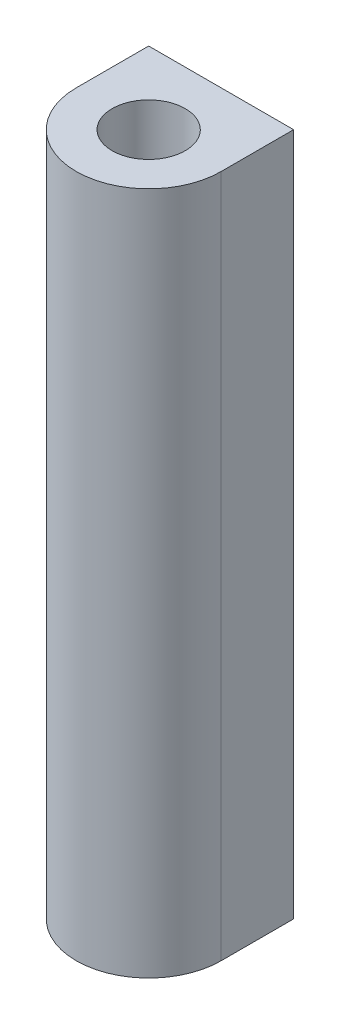
ISO-10303-21;
HEADER;
FILE_DESCRIPTION(('STEP AP214'),'2;1');
FILE_NAME('part.step','',(''),(''),'','','');
FILE_SCHEMA(('AUTOMOTIVE_DESIGN { 1 0 10303 214 1 1 1 1 }'));
ENDSEC;
DATA;
#1=APPLICATION_CONTEXT('core data for automotive mechanical design processes');
#2=APPLICATION_PROTOCOL_DEFINITION('international standard','automotive_design',2000,#1);
#3=PRODUCT_CONTEXT('',#1,'mechanical');
#4=PRODUCT('Part','Part','',(#3));
#5=PRODUCT_RELATED_PRODUCT_CATEGORY('part','',(#4));
#6=PRODUCT_DEFINITION_FORMATION('','',#4);
#7=PRODUCT_DEFINITION_CONTEXT('part definition',#1,'design');
#8=PRODUCT_DEFINITION('design','',#6,#7);
#9=PRODUCT_DEFINITION_SHAPE('','',#8);
#10=(LENGTH_UNIT() NAMED_UNIT(*) SI_UNIT(.MILLI.,.METRE.));
#11=(NAMED_UNIT(*) PLANE_ANGLE_UNIT() SI_UNIT($,.RADIAN.));
#12=(NAMED_UNIT(*) SI_UNIT($,.STERADIAN.) SOLID_ANGLE_UNIT());
#13=UNCERTAINTY_MEASURE_WITH_UNIT(LENGTH_MEASURE(1.E-05),#10,'distance_accuracy_value','');
#14=(GEOMETRIC_REPRESENTATION_CONTEXT(3) GLOBAL_UNCERTAINTY_ASSIGNED_CONTEXT((#13)) GLOBAL_UNIT_ASSIGNED_CONTEXT((#10,
#11,#12)) REPRESENTATION_CONTEXT('',''));
#15=CARTESIAN_POINT('',(0.,0.,0.));
#16=DIRECTION('',(0.,0.,1.));
#17=DIRECTION('',(1.,0.,0.));
#18=AXIS2_PLACEMENT_3D('',#15,#16,#17);
#19=CARTESIAN_POINT('',(0.,56.6,0.));
#20=DIRECTION('',(0.,1.,0.));
#21=DIRECTION('',(0.,0.,1.));
#22=AXIS2_PLACEMENT_3D('',#19,#20,#21);
#23=PLANE('',#22);
#24=DIRECTION('',(0.,0.,-1.));
#25=VECTOR('',#24,1.);
#26=CARTESIAN_POINT('',(-6.,56.6,0.));
#27=LINE('',#26,#25);
#28=CARTESIAN_POINT('',(-6.,56.6,0.));
#29=VERTEX_POINT('',#28);
#30=CARTESIAN_POINT('',(-6.,56.6,-6.));
#31=VERTEX_POINT('',#30);
#32=EDGE_CURVE('E95',#29,#31,#27,.T.);
#33=ORIENTED_EDGE('',*,*,#32,.F.);
#34=CARTESIAN_POINT('',(0.,56.6,0.));
#35=DIRECTION('',(0.,1.,0.));
#36=DIRECTION('',(0.,0.,1.));
#37=AXIS2_PLACEMENT_3D('',#34,#35,#36);
#38=CIRCLE('',#37,6.);
#39=CARTESIAN_POINT('',(6.,56.6,0.));
#40=VERTEX_POINT('',#39);
#41=EDGE_CURVE('E114',#29,#40,#38,.T.);
#42=ORIENTED_EDGE('',*,*,#41,.T.);
#43=DIRECTION('',(0.,0.,1.));
#44=VECTOR('',#43,1.);
#45=CARTESIAN_POINT('',(6.,56.6,-6.));
#46=LINE('',#45,#44);
#47=CARTESIAN_POINT('',(6.,56.6,-6.));
#48=VERTEX_POINT('',#47);
#49=EDGE_CURVE('E102',#48,#40,#46,.T.);
#50=ORIENTED_EDGE('',*,*,#49,.F.);
#51=DIRECTION('',(1.,0.,0.));
#52=VECTOR('',#51,1.);
#53=CARTESIAN_POINT('',(-6.,56.6,-6.));
#54=LINE('',#53,#52);
#55=EDGE_CURVE('E113',#31,#48,#54,.T.);
#56=ORIENTED_EDGE('',*,*,#55,.F.);
#57=EDGE_LOOP('',(#33,#42,#50,#56));
#58=FACE_BOUND('',#57,.T.);
#59=CARTESIAN_POINT('',(0.,56.6,0.));
#60=DIRECTION('',(0.,1.,0.));
#61=DIRECTION('',(0.,0.,1.));
#62=AXIS2_PLACEMENT_3D('',#59,#60,#61);
#63=CIRCLE('',#62,3.025);
#64=CARTESIAN_POINT('',(0.,56.6,3.025));
#65=VERTEX_POINT('',#64);
#66=EDGE_CURVE('E125',#65,#65,#63,.T.);
#67=ORIENTED_EDGE('',*,*,#66,.F.);
#68=EDGE_LOOP('',(#67));
#69=FACE_BOUND('',#68,.T.);
#70=ADVANCED_FACE('F56',(#58,#69),#23,.T.);
#71=CARTESIAN_POINT('',(0.,0.,0.));
#72=DIRECTION('',(0.,1.,0.));
#73=DIRECTION('',(0.,0.,1.));
#74=AXIS2_PLACEMENT_3D('',#71,#72,#73);
#75=PLANE('',#74);
#76=CARTESIAN_POINT('',(0.,0.,0.));
#77=DIRECTION('',(0.,1.,0.));
#78=DIRECTION('',(0.,0.,1.));
#79=AXIS2_PLACEMENT_3D('',#76,#77,#78);
#80=CIRCLE('',#79,6.);
#81=CARTESIAN_POINT('',(-6.,0.,0.));
#82=VERTEX_POINT('',#81);
#83=CARTESIAN_POINT('',(6.,0.,0.));
#84=VERTEX_POINT('',#83);
#85=EDGE_CURVE('E118',#82,#84,#80,.T.);
#86=ORIENTED_EDGE('',*,*,#85,.F.);
#87=DIRECTION('',(0.,0.,-1.));
#88=VECTOR('',#87,1.);
#89=CARTESIAN_POINT('',(-6.,0.,-5.43));
#90=LINE('',#89,#88);
#91=CARTESIAN_POINT('',(-6.,0.,-6.));
#92=VERTEX_POINT('',#91);
#93=EDGE_CURVE('E92',#82,#92,#90,.T.);
#94=ORIENTED_EDGE('',*,*,#93,.T.);
#95=DIRECTION('',(1.,0.,0.));
#96=VECTOR('',#95,1.);
#97=CARTESIAN_POINT('',(-6.,0.,-6.));
#98=LINE('',#97,#96);
#99=CARTESIAN_POINT('',(6.,0.,-6.));
#100=VERTEX_POINT('',#99);
#101=EDGE_CURVE('E124',#92,#100,#98,.T.);
#102=ORIENTED_EDGE('',*,*,#101,.T.);
#103=DIRECTION('',(0.,0.,1.));
#104=VECTOR('',#103,1.);
#105=CARTESIAN_POINT('',(6.,0.,-5.43));
#106=LINE('',#105,#104);
#107=EDGE_CURVE('E105',#100,#84,#106,.T.);
#108=ORIENTED_EDGE('',*,*,#107,.T.);
#109=EDGE_LOOP('',(#86,#94,#102,#108));
#110=FACE_BOUND('',#109,.T.);
#111=CARTESIAN_POINT('',(0.,0.,0.));
#112=DIRECTION('',(0.,1.,0.));
#113=DIRECTION('',(0.,0.,1.));
#114=AXIS2_PLACEMENT_3D('',#111,#112,#113);
#115=CIRCLE('',#114,3.025);
#116=CARTESIAN_POINT('',(0.,0.,3.025));
#117=VERTEX_POINT('',#116);
#118=EDGE_CURVE('E139',#117,#117,#115,.T.);
#119=ORIENTED_EDGE('',*,*,#118,.T.);
#120=EDGE_LOOP('',(#119));
#121=FACE_BOUND('',#120,.T.);
#122=ADVANCED_FACE('F133',(#110,#121),#75,.F.);
#123=CARTESIAN_POINT('',(0.,56.6,0.));
#124=DIRECTION('',(0.,-1.,0.));
#125=DIRECTION('',(0.,0.,-1.));
#126=AXIS2_PLACEMENT_3D('',#123,#124,#125);
#127=CYLINDRICAL_SURFACE('',#126,6.);
#128=ORIENTED_EDGE('',*,*,#85,.T.);
#129=DIRECTION('',(0.,-1.,0.));
#130=VECTOR('',#129,1.);
#131=CARTESIAN_POINT('',(6.,56.6,0.));
#132=LINE('',#131,#130);
#133=EDGE_CURVE('E66',#40,#84,#132,.T.);
#134=ORIENTED_EDGE('',*,*,#133,.F.);
#135=ORIENTED_EDGE('',*,*,#41,.F.);
#136=DIRECTION('',(0.,-1.,0.));
#137=VECTOR('',#136,1.);
#138=CARTESIAN_POINT('',(-6.,56.6,0.));
#139=LINE('',#138,#137);
#140=EDGE_CURVE('E12',#29,#82,#139,.T.);
#141=ORIENTED_EDGE('',*,*,#140,.T.);
#142=EDGE_LOOP('',(#128,#134,#135,#141));
#143=FACE_BOUND('',#142,.T.);
#144=ADVANCED_FACE('F131',(#143),#127,.T.);
#145=CARTESIAN_POINT('',(6.,56.6,-5.43));
#146=DIRECTION('',(1.,0.,0.));
#147=DIRECTION('',(0.,0.,-1.));
#148=AXIS2_PLACEMENT_3D('',#145,#146,#147);
#149=PLANE('',#148);
#150=ORIENTED_EDGE('',*,*,#107,.F.);
#151=DIRECTION('',(0.,-1.,0.));
#152=VECTOR('',#151,1.);
#153=CARTESIAN_POINT('',(6.,56.6,-6.));
#154=LINE('',#153,#152);
#155=EDGE_CURVE('E99',#48,#100,#154,.T.);
#156=ORIENTED_EDGE('',*,*,#155,.F.);
#157=ORIENTED_EDGE('',*,*,#49,.T.);
#158=ORIENTED_EDGE('',*,*,#133,.T.);
#159=EDGE_LOOP('',(#150,#156,#157,#158));
#160=FACE_BOUND('',#159,.T.);
#161=ADVANCED_FACE('F101',(#160),#149,.T.);
#162=CARTESIAN_POINT('',(-6.,56.6,-6.));
#163=DIRECTION('',(0.,0.,-1.));
#164=DIRECTION('',(-1.,0.,0.));
#165=AXIS2_PLACEMENT_3D('',#162,#163,#164);
#166=PLANE('',#165);
#167=ORIENTED_EDGE('',*,*,#101,.F.);
#168=DIRECTION('',(0.,-1.,0.));
#169=VECTOR('',#168,1.);
#170=CARTESIAN_POINT('',(-6.,56.6,-6.));
#171=LINE('',#170,#169);
#172=EDGE_CURVE('E60',#31,#92,#171,.T.);
#173=ORIENTED_EDGE('',*,*,#172,.F.);
#174=ORIENTED_EDGE('',*,*,#55,.T.);
#175=ORIENTED_EDGE('',*,*,#155,.T.);
#176=EDGE_LOOP('',(#167,#173,#174,#175));
#177=FACE_BOUND('',#176,.T.);
#178=ADVANCED_FACE('F116',(#177),#166,.T.);
#179=CARTESIAN_POINT('',(-6.,56.6,-5.43));
#180=DIRECTION('',(-1.,0.,0.));
#181=DIRECTION('',(0.,0.,1.));
#182=AXIS2_PLACEMENT_3D('',#179,#180,#181);
#183=PLANE('',#182);
#184=ORIENTED_EDGE('',*,*,#93,.F.);
#185=ORIENTED_EDGE('',*,*,#140,.F.);
#186=ORIENTED_EDGE('',*,*,#32,.T.);
#187=ORIENTED_EDGE('',*,*,#172,.T.);
#188=EDGE_LOOP('',(#184,#185,#186,#187));
#189=FACE_BOUND('',#188,.T.);
#190=ADVANCED_FACE('F58',(#189),#183,.T.);
#191=CARTESIAN_POINT('',(0.,56.6,0.));
#192=DIRECTION('',(0.,-1.,0.));
#193=DIRECTION('',(0.,0.,-1.));
#194=AXIS2_PLACEMENT_3D('',#191,#192,#193);
#195=CYLINDRICAL_SURFACE('',#194,3.025);
#196=ORIENTED_EDGE('',*,*,#66,.T.);
#197=EDGE_LOOP('',(#196));
#198=FACE_BOUND('',#197,.T.);
#199=ORIENTED_EDGE('',*,*,#118,.F.);
#200=EDGE_LOOP('',(#199));
#201=FACE_BOUND('',#200,.T.);
#202=ADVANCED_FACE('F145',(#198,#201),#195,.F.);
#203=CLOSED_SHELL('',(#70,#122,#144,#161,#178,#190,#202));
#204=MANIFOLD_SOLID_BREP('B2',#203);
#205=ADVANCED_BREP_SHAPE_REPRESENTATION('',(#18,#204),#14);
#206=SHAPE_DEFINITION_REPRESENTATION(#9,#205);
ENDSEC;
END-ISO-10303-21;
